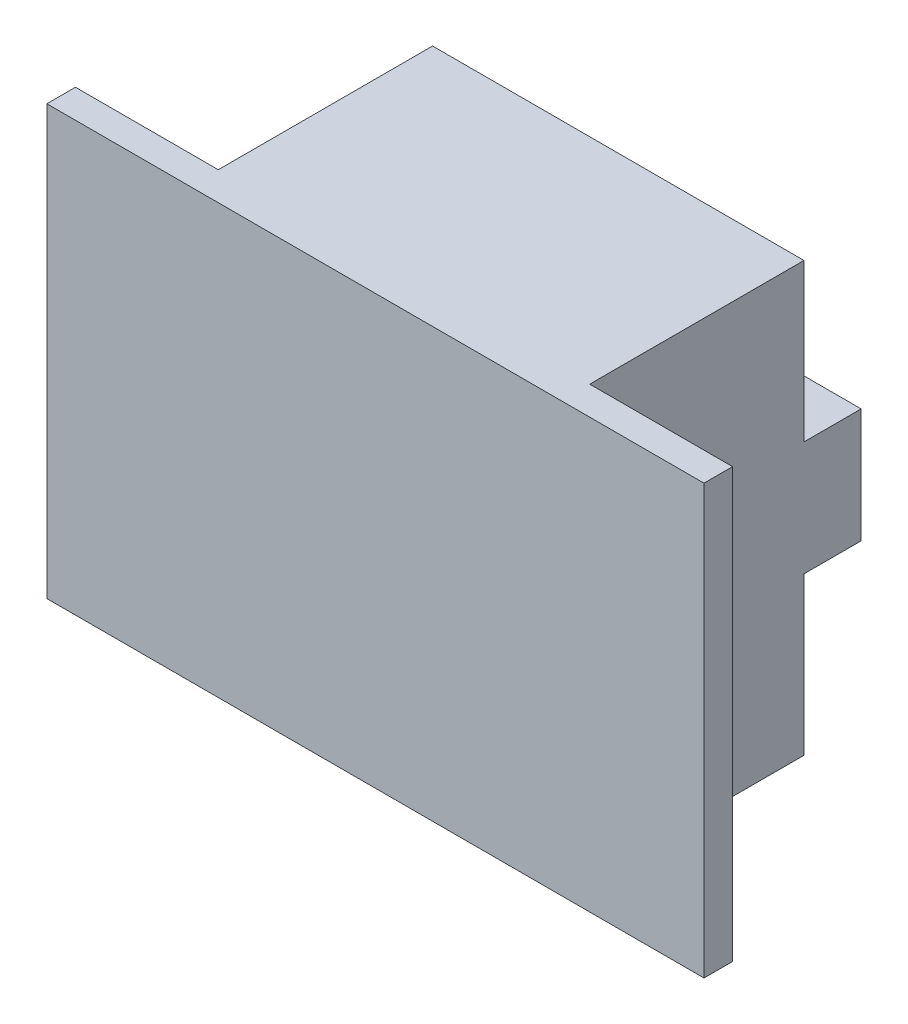
ISO-10303-21;
HEADER;
FILE_DESCRIPTION(('STEP AP214'),'2;1');
FILE_NAME('part.step','',(''),(''),'','','');
FILE_SCHEMA(('AUTOMOTIVE_DESIGN { 1 0 10303 214 1 1 1 1 }'));
ENDSEC;
DATA;
#1=APPLICATION_CONTEXT('core data for automotive mechanical design processes');
#2=APPLICATION_PROTOCOL_DEFINITION('international standard','automotive_design',2000,#1);
#3=PRODUCT_CONTEXT('',#1,'mechanical');
#4=PRODUCT('Part','Part','',(#3));
#5=PRODUCT_RELATED_PRODUCT_CATEGORY('part','',(#4));
#6=PRODUCT_DEFINITION_FORMATION('','',#4);
#7=PRODUCT_DEFINITION_CONTEXT('part definition',#1,'design');
#8=PRODUCT_DEFINITION('design','',#6,#7);
#9=PRODUCT_DEFINITION_SHAPE('','',#8);
#10=(LENGTH_UNIT() NAMED_UNIT(*) SI_UNIT(.MILLI.,.METRE.));
#11=(NAMED_UNIT(*) PLANE_ANGLE_UNIT() SI_UNIT($,.RADIAN.));
#12=(NAMED_UNIT(*) SI_UNIT($,.STERADIAN.) SOLID_ANGLE_UNIT());
#13=UNCERTAINTY_MEASURE_WITH_UNIT(LENGTH_MEASURE(1.E-05),#10,'distance_accuracy_value','');
#14=(GEOMETRIC_REPRESENTATION_CONTEXT(3) GLOBAL_UNCERTAINTY_ASSIGNED_CONTEXT((#13)) GLOBAL_UNIT_ASSIGNED_CONTEXT((#10,
#11,#12)) REPRESENTATION_CONTEXT('',''));
#15=CARTESIAN_POINT('',(0.,0.,0.));
#16=DIRECTION('',(0.,0.,1.));
#17=DIRECTION('',(1.,0.,0.));
#18=AXIS2_PLACEMENT_3D('',#15,#16,#17);
#19=CARTESIAN_POINT('',(0.,0.,0.));
#20=DIRECTION('',(0.,0.,1.));
#21=DIRECTION('',(1.,0.,0.));
#22=AXIS2_PLACEMENT_3D('',#19,#20,#21);
#23=PLANE('',#22);
#24=DIRECTION('',(1.,0.,0.));
#25=VECTOR('',#24,1.);
#26=CARTESIAN_POINT('',(-473.000000000026,4.,0.));
#27=LINE('',#26,#25);
#28=CARTESIAN_POINT('',(-473.000000000026,4.,0.));
#29=VERTEX_POINT('',#28);
#30=CARTESIAN_POINT('',(-447.000000000026,4.,0.));
#31=VERTEX_POINT('',#30);
#32=EDGE_CURVE('E54',#29,#31,#27,.T.);
#33=ORIENTED_EDGE('',*,*,#32,.F.);
#34=DIRECTION('',(0.,-1.,0.));
#35=VECTOR('',#34,1.);
#36=CARTESIAN_POINT('',(-473.000000000026,15.0000000000009,0.));
#37=LINE('',#36,#35);
#38=CARTESIAN_POINT('',(-473.000000000026,15.0000000000009,0.));
#39=VERTEX_POINT('',#38);
#40=EDGE_CURVE('E203',#39,#29,#37,.T.);
#41=ORIENTED_EDGE('',*,*,#40,.F.);
#42=DIRECTION('',(-1.,0.,0.));
#43=VECTOR('',#42,1.);
#44=CARTESIAN_POINT('',(-447.000000000026,15.0000000000009,0.));
#45=LINE('',#44,#43);
#46=CARTESIAN_POINT('',(-447.000000000026,15.0000000000009,0.));
#47=VERTEX_POINT('',#46);
#48=EDGE_CURVE('E200',#47,#39,#45,.T.);
#49=ORIENTED_EDGE('',*,*,#48,.F.);
#50=DIRECTION('',(0.,1.,0.));
#51=VECTOR('',#50,1.);
#52=CARTESIAN_POINT('',(-447.000000000026,-14.9999999999991,0.));
#53=LINE('',#52,#51);
#54=EDGE_CURVE('E59',#31,#47,#53,.T.);
#55=ORIENTED_EDGE('',*,*,#54,.F.);
#56=EDGE_LOOP('',(#33,#41,#49,#55));
#57=FACE_BOUND('',#56,.T.);
#58=ADVANCED_FACE('F39',(#57),#23,.F.);
#59=DIRECTION('',(-1.,0.,0.));
#60=VECTOR('',#59,1.);
#61=CARTESIAN_POINT('',(-447.000000000026,-4.,0.));
#62=LINE('',#61,#60);
#63=CARTESIAN_POINT('',(-447.000000000026,-4.,0.));
#64=VERTEX_POINT('',#63);
#65=CARTESIAN_POINT('',(-473.000000000026,-4.,0.));
#66=VERTEX_POINT('',#65);
#67=EDGE_CURVE('E380',#64,#66,#62,.T.);
#68=ORIENTED_EDGE('',*,*,#67,.F.);
#69=CARTESIAN_POINT('',(-447.000000000026,-14.9999999999991,0.));
#70=VERTEX_POINT('',#69);
#71=EDGE_CURVE('E151',#70,#64,#53,.T.);
#72=ORIENTED_EDGE('',*,*,#71,.F.);
#73=DIRECTION('',(1.,0.,0.));
#74=VECTOR('',#73,1.);
#75=CARTESIAN_POINT('',(-473.000000000026,-14.9999999999991,0.));
#76=LINE('',#75,#74);
#77=CARTESIAN_POINT('',(-473.000000000026,-14.9999999999991,0.));
#78=VERTEX_POINT('',#77);
#79=EDGE_CURVE('E195',#78,#70,#76,.T.);
#80=ORIENTED_EDGE('',*,*,#79,.F.);
#81=EDGE_CURVE('E202',#66,#78,#37,.T.);
#82=ORIENTED_EDGE('',*,*,#81,.F.);
#83=EDGE_LOOP('',(#68,#72,#80,#82));
#84=FACE_BOUND('',#83,.T.);
#85=ADVANCED_FACE('F254',(#84),#23,.F.);
#86=CARTESIAN_POINT('',(-447.000000000026,-14.9999999999991,15.));
#87=DIRECTION('',(-1.,0.,0.));
#88=DIRECTION('',(0.,-1.,0.));
#89=AXIS2_PLACEMENT_3D('',#86,#87,#88);
#90=PLANE('',#89);
#91=ORIENTED_EDGE('',*,*,#71,.T.);
#92=DIRECTION('',(0.,0.,1.));
#93=VECTOR('',#92,1.);
#94=CARTESIAN_POINT('',(-447.000000000026,-4.,-4.));
#95=LINE('',#94,#93);
#96=CARTESIAN_POINT('',(-447.000000000026,-4.,-4.));
#97=VERTEX_POINT('',#96);
#98=EDGE_CURVE('E132',#97,#64,#95,.T.);
#99=ORIENTED_EDGE('',*,*,#98,.F.);
#100=DIRECTION('',(0.,-1.,0.));
#101=VECTOR('',#100,1.);
#102=CARTESIAN_POINT('',(-447.000000000026,4.,-4.));
#103=LINE('',#102,#101);
#104=CARTESIAN_POINT('',(-447.000000000026,4.,-4.));
#105=VERTEX_POINT('',#104);
#106=EDGE_CURVE('E138',#105,#97,#103,.T.);
#107=ORIENTED_EDGE('',*,*,#106,.F.);
#108=DIRECTION('',(0.,0.,1.));
#109=VECTOR('',#108,1.);
#110=CARTESIAN_POINT('',(-447.000000000026,4.,-4.));
#111=LINE('',#110,#109);
#112=EDGE_CURVE('E379',#105,#31,#111,.T.);
#113=ORIENTED_EDGE('',*,*,#112,.T.);
#114=ORIENTED_EDGE('',*,*,#54,.T.);
#115=DIRECTION('',(0.,0.,-1.));
#116=VECTOR('',#115,1.);
#117=CARTESIAN_POINT('',(-447.000000000026,15.0000000000009,15.));
#118=LINE('',#117,#116);
#119=CARTESIAN_POINT('',(-447.000000000026,15.0000000000009,15.));
#120=VERTEX_POINT('',#119);
#121=EDGE_CURVE('E11',#120,#47,#118,.T.);
#122=ORIENTED_EDGE('',*,*,#121,.F.);
#123=DIRECTION('',(0.,1.,0.));
#124=VECTOR('',#123,1.);
#125=CARTESIAN_POINT('',(-447.000000000026,-14.9999999999991,15.));
#126=LINE('',#125,#124);
#127=CARTESIAN_POINT('',(-447.000000000026,-14.9999999999991,15.));
#128=VERTEX_POINT('',#127);
#129=EDGE_CURVE('E191',#128,#120,#126,.T.);
#130=ORIENTED_EDGE('',*,*,#129,.F.);
#131=DIRECTION('',(0.,0.,-1.));
#132=VECTOR('',#131,1.);
#133=CARTESIAN_POINT('',(-447.000000000026,-14.9999999999991,15.));
#134=LINE('',#133,#132);
#135=EDGE_CURVE('E198',#128,#70,#134,.T.);
#136=ORIENTED_EDGE('',*,*,#135,.T.);
#137=EDGE_LOOP('',(#91,#99,#107,#113,#114,#122,#130,#136));
#138=FACE_BOUND('',#137,.T.);
#139=ADVANCED_FACE('F41',(#138),#90,.F.);
#140=CARTESIAN_POINT('',(-447.000000000026,15.0000000000009,15.));
#141=DIRECTION('',(0.,-1.,0.));
#142=DIRECTION('',(1.,0.,0.));
#143=AXIS2_PLACEMENT_3D('',#140,#141,#142);
#144=PLANE('',#143);
#145=ORIENTED_EDGE('',*,*,#48,.T.);
#146=DIRECTION('',(0.,0.,-1.));
#147=VECTOR('',#146,1.);
#148=CARTESIAN_POINT('',(-473.000000000026,15.0000000000009,15.));
#149=LINE('',#148,#147);
#150=CARTESIAN_POINT('',(-473.000000000026,15.0000000000009,15.));
#151=VERTEX_POINT('',#150);
#152=EDGE_CURVE('E47',#151,#39,#149,.T.);
#153=ORIENTED_EDGE('',*,*,#152,.F.);
#154=DIRECTION('',(-1.,0.,0.));
#155=VECTOR('',#154,1.);
#156=CARTESIAN_POINT('',(-483.000000000026,15.0000000000009,15.));
#157=LINE('',#156,#155);
#158=CARTESIAN_POINT('',(-483.000000000026,15.0000000000009,15.));
#159=VERTEX_POINT('',#158);
#160=EDGE_CURVE('E177',#151,#159,#157,.T.);
#161=ORIENTED_EDGE('',*,*,#160,.T.);
#162=DIRECTION('',(0.,0.,-1.));
#163=VECTOR('',#162,1.);
#164=CARTESIAN_POINT('',(-483.000000000026,15.0000000000009,17.));
#165=LINE('',#164,#163);
#166=CARTESIAN_POINT('',(-483.000000000026,15.0000000000009,17.));
#167=VERTEX_POINT('',#166);
#168=EDGE_CURVE('E170',#167,#159,#165,.T.);
#169=ORIENTED_EDGE('',*,*,#168,.F.);
#170=DIRECTION('',(-1.,0.,0.));
#171=VECTOR('',#170,1.);
#172=CARTESIAN_POINT('',(-483.000000000026,15.0000000000009,17.));
#173=LINE('',#172,#171);
#174=CARTESIAN_POINT('',(-437.000000000026,15.0000000000009,17.));
#175=VERTEX_POINT('',#174);
#176=EDGE_CURVE('E169',#175,#167,#173,.T.);
#177=ORIENTED_EDGE('',*,*,#176,.F.);
#178=DIRECTION('',(0.,0.,-1.));
#179=VECTOR('',#178,1.);
#180=CARTESIAN_POINT('',(-437.000000000026,15.0000000000009,17.));
#181=LINE('',#180,#179);
#182=CARTESIAN_POINT('',(-437.000000000026,15.0000000000009,15.));
#183=VERTEX_POINT('',#182);
#184=EDGE_CURVE('E182',#175,#183,#181,.T.);
#185=ORIENTED_EDGE('',*,*,#184,.T.);
#186=EDGE_CURVE('E165',#183,#120,#157,.T.);
#187=ORIENTED_EDGE('',*,*,#186,.T.);
#188=ORIENTED_EDGE('',*,*,#121,.T.);
#189=EDGE_LOOP('',(#145,#153,#161,#169,#177,#185,#187,#188));
#190=FACE_BOUND('',#189,.T.);
#191=ADVANCED_FACE('F217',(#190),#144,.F.);
#192=CARTESIAN_POINT('',(-473.000000000026,15.0000000000009,15.));
#193=DIRECTION('',(1.,0.,0.));
#194=DIRECTION('',(0.,0.,-1.));
#195=AXIS2_PLACEMENT_3D('',#192,#193,#194);
#196=PLANE('',#195);
#197=ORIENTED_EDGE('',*,*,#40,.T.);
#198=DIRECTION('',(0.,0.,1.));
#199=VECTOR('',#198,1.);
#200=CARTESIAN_POINT('',(-473.000000000026,4.,-4.));
#201=LINE('',#200,#199);
#202=CARTESIAN_POINT('',(-473.000000000026,4.,-4.));
#203=VERTEX_POINT('',#202);
#204=EDGE_CURVE('E157',#203,#29,#201,.T.);
#205=ORIENTED_EDGE('',*,*,#204,.F.);
#206=DIRECTION('',(0.,1.,0.));
#207=VECTOR('',#206,1.);
#208=CARTESIAN_POINT('',(-473.000000000026,-4.,-4.));
#209=LINE('',#208,#207);
#210=CARTESIAN_POINT('',(-473.000000000026,-4.,-4.));
#211=VERTEX_POINT('',#210);
#212=EDGE_CURVE('E137',#211,#203,#209,.T.);
#213=ORIENTED_EDGE('',*,*,#212,.F.);
#214=DIRECTION('',(0.,0.,1.));
#215=VECTOR('',#214,1.);
#216=CARTESIAN_POINT('',(-473.000000000026,-4.,-4.));
#217=LINE('',#216,#215);
#218=EDGE_CURVE('E134',#211,#66,#217,.T.);
#219=ORIENTED_EDGE('',*,*,#218,.T.);
#220=ORIENTED_EDGE('',*,*,#81,.T.);
#221=DIRECTION('',(0.,0.,-1.));
#222=VECTOR('',#221,1.);
#223=CARTESIAN_POINT('',(-473.000000000026,-14.9999999999991,15.));
#224=LINE('',#223,#222);
#225=CARTESIAN_POINT('',(-473.000000000026,-14.9999999999991,15.));
#226=VERTEX_POINT('',#225);
#227=EDGE_CURVE('E207',#226,#78,#224,.T.);
#228=ORIENTED_EDGE('',*,*,#227,.F.);
#229=DIRECTION('',(0.,-1.,0.));
#230=VECTOR('',#229,1.);
#231=CARTESIAN_POINT('',(-473.000000000026,15.0000000000009,15.));
#232=LINE('',#231,#230);
#233=EDGE_CURVE('E194',#151,#226,#232,.T.);
#234=ORIENTED_EDGE('',*,*,#233,.F.);
#235=ORIENTED_EDGE('',*,*,#152,.T.);
#236=EDGE_LOOP('',(#197,#205,#213,#219,#220,#228,#234,#235));
#237=FACE_BOUND('',#236,.T.);
#238=ADVANCED_FACE('F212',(#237),#196,.F.);
#239=CARTESIAN_POINT('',(-473.000000000026,-14.9999999999991,15.));
#240=DIRECTION('',(0.,1.,0.));
#241=DIRECTION('',(-1.,0.,0.));
#242=AXIS2_PLACEMENT_3D('',#239,#240,#241);
#243=PLANE('',#242);
#244=ORIENTED_EDGE('',*,*,#79,.T.);
#245=ORIENTED_EDGE('',*,*,#135,.F.);
#246=DIRECTION('',(1.,0.,0.));
#247=VECTOR('',#246,1.);
#248=CARTESIAN_POINT('',(-483.000000000026,-14.9999999999991,15.));
#249=LINE('',#248,#247);
#250=CARTESIAN_POINT('',(-437.000000000026,-14.9999999999991,15.));
#251=VERTEX_POINT('',#250);
#252=EDGE_CURVE('E155',#128,#251,#249,.T.);
#253=ORIENTED_EDGE('',*,*,#252,.T.);
#254=DIRECTION('',(0.,0.,-1.));
#255=VECTOR('',#254,1.);
#256=CARTESIAN_POINT('',(-437.000000000026,-14.9999999999991,17.));
#257=LINE('',#256,#255);
#258=CARTESIAN_POINT('',(-437.000000000026,-14.9999999999991,17.));
#259=VERTEX_POINT('',#258);
#260=EDGE_CURVE('E185',#259,#251,#257,.T.);
#261=ORIENTED_EDGE('',*,*,#260,.F.);
#262=DIRECTION('',(1.,0.,0.));
#263=VECTOR('',#262,1.);
#264=CARTESIAN_POINT('',(-483.000000000026,-14.9999999999991,17.));
#265=LINE('',#264,#263);
#266=CARTESIAN_POINT('',(-483.000000000026,-14.9999999999991,17.));
#267=VERTEX_POINT('',#266);
#268=EDGE_CURVE('E164',#267,#259,#265,.T.);
#269=ORIENTED_EDGE('',*,*,#268,.F.);
#270=DIRECTION('',(0.,0.,-1.));
#271=VECTOR('',#270,1.);
#272=CARTESIAN_POINT('',(-483.000000000026,-14.9999999999991,17.));
#273=LINE('',#272,#271);
#274=CARTESIAN_POINT('',(-483.000000000026,-14.9999999999991,15.));
#275=VERTEX_POINT('',#274);
#276=EDGE_CURVE('E188',#267,#275,#273,.T.);
#277=ORIENTED_EDGE('',*,*,#276,.T.);
#278=EDGE_CURVE('E172',#275,#226,#249,.T.);
#279=ORIENTED_EDGE('',*,*,#278,.T.);
#280=ORIENTED_EDGE('',*,*,#227,.T.);
#281=EDGE_LOOP('',(#244,#245,#253,#261,#269,#277,#279,#280));
#282=FACE_BOUND('',#281,.T.);
#283=ADVANCED_FACE('F226',(#282),#243,.F.);
#284=CARTESIAN_POINT('',(0.,0.,15.));
#285=DIRECTION('',(0.,0.,-1.));
#286=DIRECTION('',(-1.,0.,0.));
#287=AXIS2_PLACEMENT_3D('',#284,#285,#286);
#288=PLANE('',#287);
#289=ORIENTED_EDGE('',*,*,#252,.F.);
#290=ORIENTED_EDGE('',*,*,#129,.T.);
#291=ORIENTED_EDGE('',*,*,#186,.F.);
#292=DIRECTION('',(0.,1.,0.));
#293=VECTOR('',#292,1.);
#294=CARTESIAN_POINT('',(-437.000000000026,-14.9999999999991,15.));
#295=LINE('',#294,#293);
#296=EDGE_CURVE('E175',#251,#183,#295,.T.);
#297=ORIENTED_EDGE('',*,*,#296,.F.);
#298=EDGE_LOOP('',(#289,#290,#291,#297));
#299=FACE_BOUND('',#298,.T.);
#300=ADVANCED_FACE('F222',(#299),#288,.T.);
#301=CARTESIAN_POINT('',(-483.000000000026,-14.9999999999991,17.));
#302=DIRECTION('',(1.,0.,0.));
#303=DIRECTION('',(0.,0.,-1.));
#304=AXIS2_PLACEMENT_3D('',#301,#302,#303);
#305=PLANE('',#304);
#306=DIRECTION('',(0.,-1.,0.));
#307=VECTOR('',#306,1.);
#308=CARTESIAN_POINT('',(-483.000000000026,-14.9999999999991,15.));
#309=LINE('',#308,#307);
#310=EDGE_CURVE('E152',#159,#275,#309,.T.);
#311=ORIENTED_EDGE('',*,*,#310,.T.);
#312=ORIENTED_EDGE('',*,*,#276,.F.);
#313=DIRECTION('',(0.,-1.,0.));
#314=VECTOR('',#313,1.);
#315=CARTESIAN_POINT('',(-483.000000000026,-14.9999999999991,17.));
#316=LINE('',#315,#314);
#317=EDGE_CURVE('E161',#167,#267,#316,.T.);
#318=ORIENTED_EDGE('',*,*,#317,.F.);
#319=ORIENTED_EDGE('',*,*,#168,.T.);
#320=EDGE_LOOP('',(#311,#312,#318,#319));
#321=FACE_BOUND('',#320,.T.);
#322=ADVANCED_FACE('F239',(#321),#305,.F.);
#323=CARTESIAN_POINT('',(-437.000000000026,-14.9999999999991,17.));
#324=DIRECTION('',(-1.,0.,0.));
#325=DIRECTION('',(0.,0.,1.));
#326=AXIS2_PLACEMENT_3D('',#323,#324,#325);
#327=PLANE('',#326);
#328=ORIENTED_EDGE('',*,*,#296,.T.);
#329=ORIENTED_EDGE('',*,*,#184,.F.);
#330=DIRECTION('',(0.,1.,0.));
#331=VECTOR('',#330,1.);
#332=CARTESIAN_POINT('',(-437.000000000026,-14.9999999999991,17.));
#333=LINE('',#332,#331);
#334=EDGE_CURVE('E167',#259,#175,#333,.T.);
#335=ORIENTED_EDGE('',*,*,#334,.F.);
#336=ORIENTED_EDGE('',*,*,#260,.T.);
#337=EDGE_LOOP('',(#328,#329,#335,#336));
#338=FACE_BOUND('',#337,.T.);
#339=ADVANCED_FACE('F229',(#338),#327,.F.);
#340=CARTESIAN_POINT('',(0.,0.,17.));
#341=DIRECTION('',(0.,0.,-1.));
#342=DIRECTION('',(-1.,0.,0.));
#343=AXIS2_PLACEMENT_3D('',#340,#341,#342);
#344=PLANE('',#343);
#345=ORIENTED_EDGE('',*,*,#317,.T.);
#346=ORIENTED_EDGE('',*,*,#268,.T.);
#347=ORIENTED_EDGE('',*,*,#334,.T.);
#348=ORIENTED_EDGE('',*,*,#176,.T.);
#349=EDGE_LOOP('',(#345,#346,#347,#348));
#350=FACE_BOUND('',#349,.T.);
#351=ADVANCED_FACE('F233',(#350),#344,.F.);
#352=ORIENTED_EDGE('',*,*,#160,.F.);
#353=ORIENTED_EDGE('',*,*,#233,.T.);
#354=ORIENTED_EDGE('',*,*,#278,.F.);
#355=ORIENTED_EDGE('',*,*,#310,.F.);
#356=EDGE_LOOP('',(#352,#353,#354,#355));
#357=FACE_BOUND('',#356,.T.);
#358=ADVANCED_FACE('F241',(#357),#288,.T.);
#359=CARTESIAN_POINT('',(-447.000000000026,-4.,-4.));
#360=DIRECTION('',(0.,1.,0.));
#361=DIRECTION('',(0.,0.,1.));
#362=AXIS2_PLACEMENT_3D('',#359,#360,#361);
#363=PLANE('',#362);
#364=ORIENTED_EDGE('',*,*,#67,.T.);
#365=ORIENTED_EDGE('',*,*,#218,.F.);
#366=DIRECTION('',(-1.,0.,0.));
#367=VECTOR('',#366,1.);
#368=CARTESIAN_POINT('',(-447.000000000026,-4.,-4.));
#369=LINE('',#368,#367);
#370=EDGE_CURVE('E127',#97,#211,#369,.T.);
#371=ORIENTED_EDGE('',*,*,#370,.F.);
#372=ORIENTED_EDGE('',*,*,#98,.T.);
#373=EDGE_LOOP('',(#364,#365,#371,#372));
#374=FACE_BOUND('',#373,.T.);
#375=ADVANCED_FACE('F130',(#374),#363,.F.);
#376=CARTESIAN_POINT('',(-473.000000000026,4.,-4.));
#377=DIRECTION('',(0.,-1.,0.));
#378=DIRECTION('',(1.,0.,0.));
#379=AXIS2_PLACEMENT_3D('',#376,#377,#378);
#380=PLANE('',#379);
#381=ORIENTED_EDGE('',*,*,#32,.T.);
#382=ORIENTED_EDGE('',*,*,#112,.F.);
#383=DIRECTION('',(1.,0.,0.));
#384=VECTOR('',#383,1.);
#385=CARTESIAN_POINT('',(-473.000000000026,4.,-4.));
#386=LINE('',#385,#384);
#387=EDGE_CURVE('E143',#203,#105,#386,.T.);
#388=ORIENTED_EDGE('',*,*,#387,.F.);
#389=ORIENTED_EDGE('',*,*,#204,.T.);
#390=EDGE_LOOP('',(#381,#382,#388,#389));
#391=FACE_BOUND('',#390,.T.);
#392=ADVANCED_FACE('F248',(#391),#380,.F.);
#393=CARTESIAN_POINT('',(0.,0.,-4.));
#394=DIRECTION('',(0.,0.,-1.));
#395=DIRECTION('',(-1.,0.,0.));
#396=AXIS2_PLACEMENT_3D('',#393,#394,#395);
#397=PLANE('',#396);
#398=ORIENTED_EDGE('',*,*,#106,.T.);
#399=ORIENTED_EDGE('',*,*,#370,.T.);
#400=ORIENTED_EDGE('',*,*,#212,.T.);
#401=ORIENTED_EDGE('',*,*,#387,.T.);
#402=EDGE_LOOP('',(#398,#399,#400,#401));
#403=FACE_BOUND('',#402,.T.);
#404=ADVANCED_FACE('F141',(#403),#397,.T.);
#405=CLOSED_SHELL('',(#58,#85,#139,#191,#238,#283,#300,#322,#339,#351,#358,#375,#392,#404));
#406=MANIFOLD_SOLID_BREP('B2',#405);
#407=ADVANCED_BREP_SHAPE_REPRESENTATION('',(#18,#406),#14);
#408=SHAPE_DEFINITION_REPRESENTATION(#9,#407);
ENDSEC;
END-ISO-10303-21;
